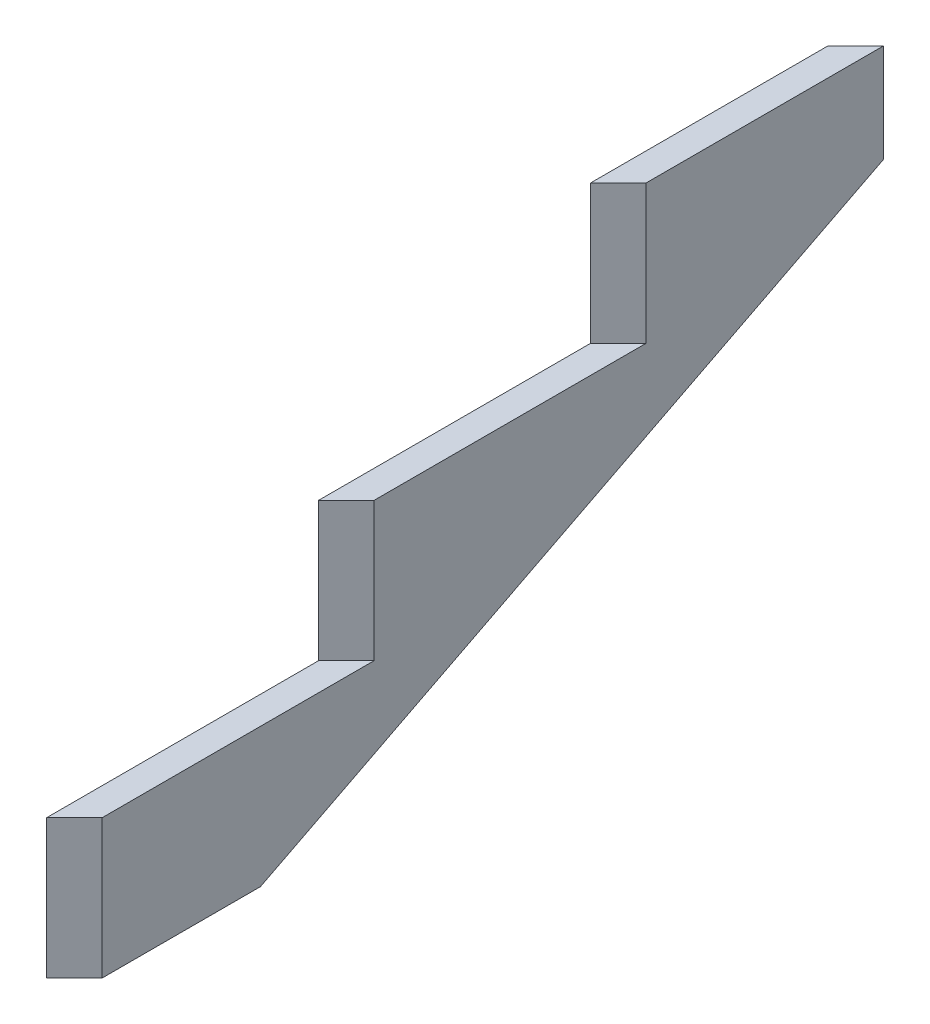
ISO-10303-21;
HEADER;
FILE_DESCRIPTION(('STEP AP214'),'2;1');
FILE_NAME('part.step','',(''),(''),'','','');
FILE_SCHEMA(('AUTOMOTIVE_DESIGN { 1 0 10303 214 1 1 1 1 }'));
ENDSEC;
DATA;
#1=APPLICATION_CONTEXT('core data for automotive mechanical design processes');
#2=APPLICATION_PROTOCOL_DEFINITION('international standard','automotive_design',2000,#1);
#3=PRODUCT_CONTEXT('',#1,'mechanical');
#4=PRODUCT('Part','Part','',(#3));
#5=PRODUCT_RELATED_PRODUCT_CATEGORY('part','',(#4));
#6=PRODUCT_DEFINITION_FORMATION('','',#4);
#7=PRODUCT_DEFINITION_CONTEXT('part definition',#1,'design');
#8=PRODUCT_DEFINITION('design','',#6,#7);
#9=PRODUCT_DEFINITION_SHAPE('','',#8);
#10=(LENGTH_UNIT() NAMED_UNIT(*) SI_UNIT(.MILLI.,.METRE.));
#11=(NAMED_UNIT(*) PLANE_ANGLE_UNIT() SI_UNIT($,.RADIAN.));
#12=(NAMED_UNIT(*) SI_UNIT($,.STERADIAN.) SOLID_ANGLE_UNIT());
#13=UNCERTAINTY_MEASURE_WITH_UNIT(LENGTH_MEASURE(1.E-05),#10,'distance_accuracy_value','');
#14=(GEOMETRIC_REPRESENTATION_CONTEXT(3) GLOBAL_UNCERTAINTY_ASSIGNED_CONTEXT((#13)) GLOBAL_UNIT_ASSIGNED_CONTEXT((#10,
#11,#12)) REPRESENTATION_CONTEXT('',''));
#15=CARTESIAN_POINT('',(0.,0.,0.));
#16=DIRECTION('',(0.,0.,1.));
#17=DIRECTION('',(1.,0.,0.));
#18=AXIS2_PLACEMENT_3D('',#15,#16,#17);
#19=CARTESIAN_POINT('',(38.1,571.5,0.));
#20=DIRECTION('',(0.,-1.,0.));
#21=DIRECTION('',(0.,0.,-1.));
#22=AXIS2_PLACEMENT_3D('',#19,#20,#21);
#23=PLANE('',#22);
#24=DIRECTION('',(0.707106781186546,0.,-0.707106781186549));
#25=VECTOR('',#24,1.);
#26=CARTESIAN_POINT('',(-372.860234146791,571.5,-372.86023414679));
#27=LINE('',#26,#25);
#28=CARTESIAN_POINT('',(0.,571.5,-745.720468293582));
#29=VERTEX_POINT('',#28);
#30=CARTESIAN_POINT('',(38.1,571.5,-783.820468293583));
#31=VERTEX_POINT('',#30);
#32=EDGE_CURVE('E150',#29,#31,#27,.T.);
#33=ORIENTED_EDGE('',*,*,#32,.T.);
#34=DIRECTION('',(0.,0.,1.));
#35=VECTOR('',#34,1.);
#36=CARTESIAN_POINT('',(38.1,571.5,0.));
#37=LINE('',#36,#35);
#38=CARTESIAN_POINT('',(38.1,571.5,-1109.6004463193));
#39=VERTEX_POINT('',#38);
#40=EDGE_CURVE('E124',#39,#31,#37,.T.);
#41=ORIENTED_EDGE('',*,*,#40,.F.);
#42=DIRECTION('',(-0.707106781186543,0.,0.707106781186552));
#43=VECTOR('',#42,1.);
#44=CARTESIAN_POINT('',(-535.750223159652,571.5,-535.750223159645));
#45=LINE('',#44,#43);
#46=CARTESIAN_POINT('',(0.,571.5,-1071.5004463193));
#47=VERTEX_POINT('',#46);
#48=EDGE_CURVE('E143',#39,#47,#45,.T.);
#49=ORIENTED_EDGE('',*,*,#48,.T.);
#50=DIRECTION('',(0.,0.,1.));
#51=VECTOR('',#50,1.);
#52=CARTESIAN_POINT('',(0.,571.5,0.));
#53=LINE('',#52,#51);
#54=EDGE_CURVE('E109',#47,#29,#53,.T.);
#55=ORIENTED_EDGE('',*,*,#54,.T.);
#56=EDGE_LOOP('',(#33,#41,#49,#55));
#57=FACE_BOUND('',#56,.T.);
#58=ADVANCED_FACE('F35',(#57),#23,.F.);
#59=CARTESIAN_POINT('',(38.1,0.,0.));
#60=DIRECTION('',(1.,0.,0.));
#61=DIRECTION('',(0.,0.,-1.));
#62=AXIS2_PLACEMENT_3D('',#59,#60,#61);
#63=PLANE('',#62);
#64=ORIENTED_EDGE('',*,*,#40,.T.);
#65=DIRECTION('',(0.,1.,0.));
#66=VECTOR('',#65,1.);
#67=CARTESIAN_POINT('',(38.1,327.118463273585,-783.820468293583));
#68=LINE('',#67,#66);
#69=CARTESIAN_POINT('',(38.1,381.,-783.820468293583));
#70=VERTEX_POINT('',#69);
#71=EDGE_CURVE('E147',#70,#31,#68,.T.);
#72=ORIENTED_EDGE('',*,*,#71,.F.);
#73=DIRECTION('',(0.,0.,-1.));
#74=VECTOR('',#73,1.);
#75=CARTESIAN_POINT('',(38.1,381.,-1.13445986899117E-13));
#76=LINE('',#75,#74);
#77=CARTESIAN_POINT('',(38.1,381.,-410.960234146791));
#78=VERTEX_POINT('',#77);
#79=EDGE_CURVE('E122',#78,#70,#76,.T.);
#80=ORIENTED_EDGE('',*,*,#79,.F.);
#81=DIRECTION('',(0.,1.,0.));
#82=VECTOR('',#81,1.);
#83=CARTESIAN_POINT('',(38.1,136.618463273585,-410.960234146791));
#84=LINE('',#83,#82);
#85=CARTESIAN_POINT('',(38.1,190.5,-410.960234146791));
#86=VERTEX_POINT('',#85);
#87=EDGE_CURVE('E84',#86,#78,#84,.T.);
#88=ORIENTED_EDGE('',*,*,#87,.F.);
#89=DIRECTION('',(0.,0.,-1.));
#90=VECTOR('',#89,1.);
#91=CARTESIAN_POINT('',(38.1,190.5,0.));
#92=LINE('',#91,#90);
#93=CARTESIAN_POINT('',(38.1,190.5,-38.1000000000001));
#94=VERTEX_POINT('',#93);
#95=EDGE_CURVE('E43',#94,#86,#92,.T.);
#96=ORIENTED_EDGE('',*,*,#95,.F.);
#97=DIRECTION('',(0.,1.,0.));
#98=VECTOR('',#97,1.);
#99=CARTESIAN_POINT('',(38.1,-53.881536726415,-38.1000000000001));
#100=LINE('',#99,#98);
#101=CARTESIAN_POINT('',(38.1,0.,-38.1000000000001));
#102=VERTEX_POINT('',#101);
#103=EDGE_CURVE('E134',#102,#94,#100,.T.);
#104=ORIENTED_EDGE('',*,*,#103,.F.);
#105=DIRECTION('',(0.,0.,-1.));
#106=VECTOR('',#105,1.);
#107=CARTESIAN_POINT('',(38.1,0.,0.));
#108=LINE('',#107,#106);
#109=CARTESIAN_POINT('',(38.1,0.,-255.19928490216));
#110=VERTEX_POINT('',#109);
#111=EDGE_CURVE('E59',#102,#110,#108,.T.);
#112=ORIENTED_EDGE('',*,*,#111,.T.);
#113=DIRECTION('',(0.,0.454972803266642,-0.890505333104577));
#114=VECTOR('',#113,1.);
#115=CARTESIAN_POINT('',(38.1,-103.395446885827,-52.8263162115477));
#116=LINE('',#115,#114);
#117=CARTESIAN_POINT('',(38.1,436.526629401535,-1109.6004463193));
#118=VERTEX_POINT('',#117);
#119=EDGE_CURVE('E129',#110,#118,#116,.T.);
#120=ORIENTED_EDGE('',*,*,#119,.T.);
#121=DIRECTION('',(0.,-1.,0.));
#122=VECTOR('',#121,1.);
#123=CARTESIAN_POINT('',(38.1,0.,-1109.6004463193));
#124=LINE('',#123,#122);
#125=EDGE_CURVE('E127',#39,#118,#124,.T.);
#126=ORIENTED_EDGE('',*,*,#125,.F.);
#127=EDGE_LOOP('',(#64,#72,#80,#88,#96,#104,#112,#120,#126));
#128=FACE_BOUND('',#127,.T.);
#129=ADVANCED_FACE('F165',(#128),#63,.T.);
#130=CARTESIAN_POINT('',(38.1,-103.395446885827,-52.8263162115477));
#131=DIRECTION('',(0.,0.890505333104577,0.454972803266642));
#132=DIRECTION('',(0.,-0.454972803266642,0.890505333104577));
#133=AXIS2_PLACEMENT_3D('',#130,#131,#132);
#134=PLANE('',#133);
#135=DIRECTION('',(0.665037921925026,0.339778052268354,-0.665037921925034));
#136=VECTOR('',#135,1.);
#137=CARTESIAN_POINT('',(-568.139809409506,126.789432682816,-503.360636909791));
#138=LINE('',#137,#136);
#139=CARTESIAN_POINT('',(0.,417.060756306732,-1071.5004463193));
#140=VERTEX_POINT('',#139);
#141=EDGE_CURVE('E50',#140,#118,#138,.T.);
#142=ORIENTED_EDGE('',*,*,#141,.T.);
#143=ORIENTED_EDGE('',*,*,#119,.F.);
#144=DIRECTION('',(-1.,0.,0.));
#145=VECTOR('',#144,1.);
#146=CARTESIAN_POINT('',(38.1,0.,-255.19928490216));
#147=LINE('',#146,#145);
#148=CARTESIAN_POINT('',(0.,0.,-255.19928490216));
#149=VERTEX_POINT('',#148);
#150=EDGE_CURVE('E11',#110,#149,#147,.T.);
#151=ORIENTED_EDGE('',*,*,#150,.T.);
#152=DIRECTION('',(0.,0.454972803266642,-0.890505333104577));
#153=VECTOR('',#152,1.);
#154=CARTESIAN_POINT('',(0.,-103.395446885827,-52.8263162115477));
#155=LINE('',#154,#153);
#156=EDGE_CURVE('E112',#149,#140,#155,.T.);
#157=ORIENTED_EDGE('',*,*,#156,.T.);
#158=EDGE_LOOP('',(#142,#143,#151,#157));
#159=FACE_BOUND('',#158,.T.);
#160=ADVANCED_FACE('F174',(#159),#134,.F.);
#161=CARTESIAN_POINT('',(0.,0.,0.));
#162=DIRECTION('',(1.,0.,0.));
#163=DIRECTION('',(0.,0.,-1.));
#164=AXIS2_PLACEMENT_3D('',#161,#162,#163);
#165=PLANE('',#164);
#166=DIRECTION('',(0.,1.,0.));
#167=VECTOR('',#166,1.);
#168=CARTESIAN_POINT('',(0.,-0.00100000000002876,-1071.5004463193));
#169=LINE('',#168,#167);
#170=EDGE_CURVE('E139',#140,#47,#169,.T.);
#171=ORIENTED_EDGE('',*,*,#170,.F.);
#172=ORIENTED_EDGE('',*,*,#156,.F.);
#173=DIRECTION('',(0.,0.,-1.));
#174=VECTOR('',#173,1.);
#175=CARTESIAN_POINT('',(0.,0.,0.));
#176=LINE('',#175,#174);
#177=CARTESIAN_POINT('',(0.,0.,0.));
#178=VERTEX_POINT('',#177);
#179=EDGE_CURVE('E115',#178,#149,#176,.T.);
#180=ORIENTED_EDGE('',*,*,#179,.F.);
#181=DIRECTION('',(0.,1.,0.));
#182=VECTOR('',#181,1.);
#183=CARTESIAN_POINT('',(0.,0.,0.));
#184=LINE('',#183,#182);
#185=CARTESIAN_POINT('',(0.,190.5,0.));
#186=VERTEX_POINT('',#185);
#187=EDGE_CURVE('E117',#178,#186,#184,.T.);
#188=ORIENTED_EDGE('',*,*,#187,.T.);
#189=DIRECTION('',(0.,0.,-1.));
#190=VECTOR('',#189,1.);
#191=CARTESIAN_POINT('',(0.,190.5,0.));
#192=LINE('',#191,#190);
#193=CARTESIAN_POINT('',(0.,190.5,-372.860234146791));
#194=VERTEX_POINT('',#193);
#195=EDGE_CURVE('E105',#186,#194,#192,.T.);
#196=ORIENTED_EDGE('',*,*,#195,.T.);
#197=DIRECTION('',(0.,1.,0.));
#198=VECTOR('',#197,1.);
#199=CARTESIAN_POINT('',(0.,0.,-372.860234146791));
#200=LINE('',#199,#198);
#201=CARTESIAN_POINT('',(0.,381.,-372.860234146791));
#202=VERTEX_POINT('',#201);
#203=EDGE_CURVE('E80',#194,#202,#200,.T.);
#204=ORIENTED_EDGE('',*,*,#203,.T.);
#205=DIRECTION('',(0.,0.,-1.));
#206=VECTOR('',#205,1.);
#207=CARTESIAN_POINT('',(0.,381.,-1.13445986899117E-13));
#208=LINE('',#207,#206);
#209=CARTESIAN_POINT('',(0.,381.,-745.720468293582));
#210=VERTEX_POINT('',#209);
#211=EDGE_CURVE('E92',#202,#210,#208,.T.);
#212=ORIENTED_EDGE('',*,*,#211,.T.);
#213=DIRECTION('',(0.,1.,0.));
#214=VECTOR('',#213,1.);
#215=CARTESIAN_POINT('',(0.,4.34601592563669E-13,-745.720468293583));
#216=LINE('',#215,#214);
#217=EDGE_CURVE('E100',#210,#29,#216,.T.);
#218=ORIENTED_EDGE('',*,*,#217,.T.);
#219=ORIENTED_EDGE('',*,*,#54,.F.);
#220=EDGE_LOOP('',(#171,#172,#180,#188,#196,#204,#212,#218,#219));
#221=FACE_BOUND('',#220,.T.);
#222=ADVANCED_FACE('F102',(#221),#165,.F.);
#223=CARTESIAN_POINT('',(38.1,0.,0.));
#224=DIRECTION('',(0.,1.,0.));
#225=DIRECTION('',(0.,0.,1.));
#226=AXIS2_PLACEMENT_3D('',#223,#224,#225);
#227=PLANE('',#226);
#228=ORIENTED_EDGE('',*,*,#111,.F.);
#229=DIRECTION('',(0.707106781186546,0.,-0.707106781186549));
#230=VECTOR('',#229,1.);
#231=CARTESIAN_POINT('',(0.,0.,0.));
#232=LINE('',#231,#230);
#233=EDGE_CURVE('E88',#178,#102,#232,.T.);
#234=ORIENTED_EDGE('',*,*,#233,.F.);
#235=ORIENTED_EDGE('',*,*,#179,.T.);
#236=ORIENTED_EDGE('',*,*,#150,.F.);
#237=EDGE_LOOP('',(#228,#234,#235,#236));
#238=FACE_BOUND('',#237,.T.);
#239=ADVANCED_FACE('F37',(#238),#227,.F.);
#240=CARTESIAN_POINT('',(38.1,381.,-1.13445986899117E-13));
#241=DIRECTION('',(0.,1.,0.));
#242=DIRECTION('',(0.,0.,1.));
#243=AXIS2_PLACEMENT_3D('',#240,#241,#242);
#244=PLANE('',#243);
#245=DIRECTION('',(-0.707106781186546,0.,0.707106781186549));
#246=VECTOR('',#245,1.);
#247=CARTESIAN_POINT('',(0.,381.,-372.860234146791));
#248=LINE('',#247,#246);
#249=EDGE_CURVE('E75',#78,#202,#248,.T.);
#250=ORIENTED_EDGE('',*,*,#249,.F.);
#251=ORIENTED_EDGE('',*,*,#79,.T.);
#252=DIRECTION('',(-0.707106781186546,0.,0.707106781186549));
#253=VECTOR('',#252,1.);
#254=CARTESIAN_POINT('',(-372.860234146791,381.,-372.86023414679));
#255=LINE('',#254,#253);
#256=EDGE_CURVE('E96',#70,#210,#255,.T.);
#257=ORIENTED_EDGE('',*,*,#256,.T.);
#258=ORIENTED_EDGE('',*,*,#211,.F.);
#259=EDGE_LOOP('',(#250,#251,#257,#258));
#260=FACE_BOUND('',#259,.T.);
#261=ADVANCED_FACE('F93',(#260),#244,.T.);
#262=CARTESIAN_POINT('',(38.1,190.5,0.));
#263=DIRECTION('',(0.,1.,0.));
#264=DIRECTION('',(0.,0.,1.));
#265=AXIS2_PLACEMENT_3D('',#262,#263,#264);
#266=PLANE('',#265);
#267=DIRECTION('',(-0.707106781186546,0.,0.707106781186549));
#268=VECTOR('',#267,1.);
#269=CARTESIAN_POINT('',(0.,190.5,0.));
#270=LINE('',#269,#268);
#271=EDGE_CURVE('E137',#94,#186,#270,.T.);
#272=ORIENTED_EDGE('',*,*,#271,.F.);
#273=ORIENTED_EDGE('',*,*,#95,.T.);
#274=DIRECTION('',(0.707106781186546,0.,-0.707106781186549));
#275=VECTOR('',#274,1.);
#276=CARTESIAN_POINT('',(0.,190.5,-372.860234146791));
#277=LINE('',#276,#275);
#278=EDGE_CURVE('E119',#194,#86,#277,.T.);
#279=ORIENTED_EDGE('',*,*,#278,.F.);
#280=ORIENTED_EDGE('',*,*,#195,.F.);
#281=EDGE_LOOP('',(#272,#273,#279,#280));
#282=FACE_BOUND('',#281,.T.);
#283=ADVANCED_FACE('F191',(#282),#266,.T.);
#284=CARTESIAN_POINT('',(0.,136.618463273585,-372.860234146791));
#285=DIRECTION('',(-0.707106781186549,0.,-0.707106781186546));
#286=DIRECTION('',(-0.707106781186546,0.,0.707106781186549));
#287=AXIS2_PLACEMENT_3D('',#284,#285,#286);
#288=PLANE('',#287);
#289=ORIENTED_EDGE('',*,*,#278,.T.);
#290=ORIENTED_EDGE('',*,*,#87,.T.);
#291=ORIENTED_EDGE('',*,*,#249,.T.);
#292=ORIENTED_EDGE('',*,*,#203,.F.);
#293=EDGE_LOOP('',(#289,#290,#291,#292));
#294=FACE_BOUND('',#293,.T.);
#295=ADVANCED_FACE('F78',(#294),#288,.F.);
#296=CARTESIAN_POINT('',(0.,-53.881536726415,0.));
#297=DIRECTION('',(-0.707106781186549,0.,-0.707106781186546));
#298=DIRECTION('',(-0.707106781186546,0.,0.707106781186549));
#299=AXIS2_PLACEMENT_3D('',#296,#297,#298);
#300=PLANE('',#299);
#301=ORIENTED_EDGE('',*,*,#233,.T.);
#302=ORIENTED_EDGE('',*,*,#103,.T.);
#303=ORIENTED_EDGE('',*,*,#271,.T.);
#304=ORIENTED_EDGE('',*,*,#187,.F.);
#305=EDGE_LOOP('',(#301,#302,#303,#304));
#306=FACE_BOUND('',#305,.T.);
#307=ADVANCED_FACE('F201',(#306),#300,.F.);
#308=CARTESIAN_POINT('',(-535.750223159652,-0.00100000000002876,-535.750223159645));
#309=DIRECTION('',(-0.707106781186552,0.,-0.707106781186543));
#310=DIRECTION('',(-0.707106781186543,0.,0.707106781186552));
#311=AXIS2_PLACEMENT_3D('',#308,#309,#310);
#312=PLANE('',#311);
#313=ORIENTED_EDGE('',*,*,#170,.T.);
#314=ORIENTED_EDGE('',*,*,#48,.F.);
#315=ORIENTED_EDGE('',*,*,#125,.T.);
#316=ORIENTED_EDGE('',*,*,#141,.F.);
#317=EDGE_LOOP('',(#313,#314,#315,#316));
#318=FACE_BOUND('',#317,.T.);
#319=ADVANCED_FACE('F171',(#318),#312,.T.);
#320=CARTESIAN_POINT('',(-372.860234146791,327.118463273585,-372.86023414679));
#321=DIRECTION('',(0.707106781186549,0.,0.707106781186546));
#322=DIRECTION('',(0.707106781186546,0.,-0.707106781186549));
#323=AXIS2_PLACEMENT_3D('',#320,#321,#322);
#324=PLANE('',#323);
#325=ORIENTED_EDGE('',*,*,#71,.T.);
#326=ORIENTED_EDGE('',*,*,#32,.F.);
#327=ORIENTED_EDGE('',*,*,#217,.F.);
#328=ORIENTED_EDGE('',*,*,#256,.F.);
#329=EDGE_LOOP('',(#325,#326,#327,#328));
#330=FACE_BOUND('',#329,.T.);
#331=ADVANCED_FACE('F193',(#330),#324,.T.);
#332=CLOSED_SHELL('',(#58,#129,#160,#222,#239,#261,#283,#295,#307,#319,#331));
#333=MANIFOLD_SOLID_BREP('B2',#332);
#334=ADVANCED_BREP_SHAPE_REPRESENTATION('',(#18,#333),#14);
#335=SHAPE_DEFINITION_REPRESENTATION(#9,#334);
ENDSEC;
END-ISO-10303-21;
